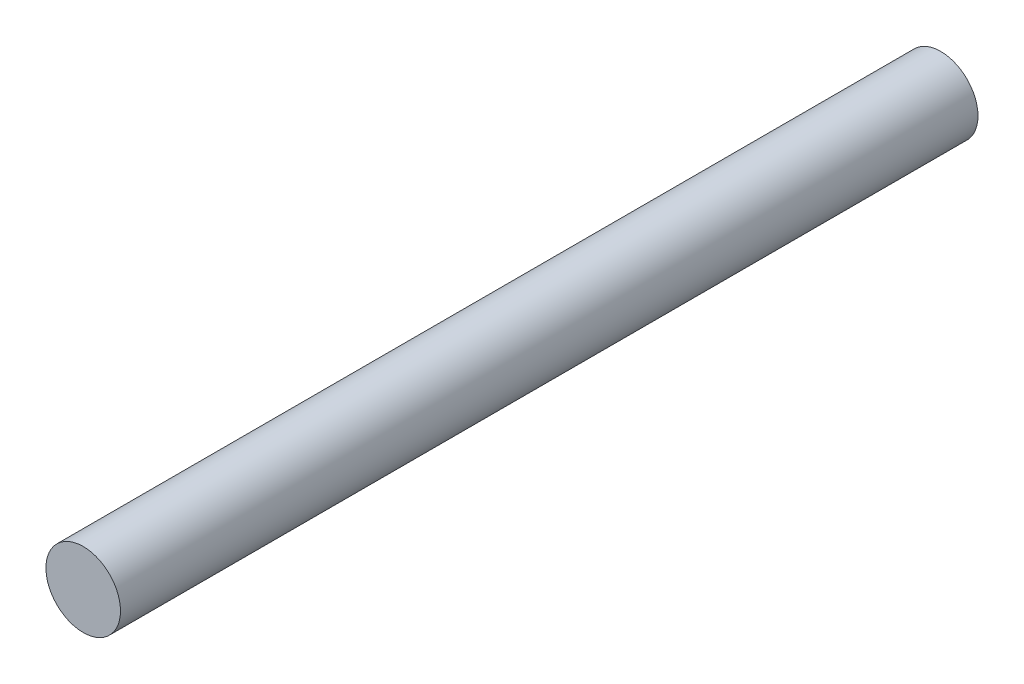
ISO-10303-21;
HEADER;
FILE_DESCRIPTION(('STEP AP214'),'2;1');
FILE_NAME('part.step','',(''),(''),'','','');
FILE_SCHEMA(('AUTOMOTIVE_DESIGN { 1 0 10303 214 1 1 1 1 }'));
ENDSEC;
DATA;
#1=APPLICATION_CONTEXT('core data for automotive mechanical design processes');
#2=APPLICATION_PROTOCOL_DEFINITION('international standard','automotive_design',2000,#1);
#3=PRODUCT_CONTEXT('',#1,'mechanical');
#4=PRODUCT('Part','Part','',(#3));
#5=PRODUCT_RELATED_PRODUCT_CATEGORY('part','',(#4));
#6=PRODUCT_DEFINITION_FORMATION('','',#4);
#7=PRODUCT_DEFINITION_CONTEXT('part definition',#1,'design');
#8=PRODUCT_DEFINITION('design','',#6,#7);
#9=PRODUCT_DEFINITION_SHAPE('','',#8);
#10=(LENGTH_UNIT() NAMED_UNIT(*) SI_UNIT(.MILLI.,.METRE.));
#11=(NAMED_UNIT(*) PLANE_ANGLE_UNIT() SI_UNIT($,.RADIAN.));
#12=(NAMED_UNIT(*) SI_UNIT($,.STERADIAN.) SOLID_ANGLE_UNIT());
#13=UNCERTAINTY_MEASURE_WITH_UNIT(LENGTH_MEASURE(1.E-05),#10,'distance_accuracy_value','');
#14=(GEOMETRIC_REPRESENTATION_CONTEXT(3) GLOBAL_UNCERTAINTY_ASSIGNED_CONTEXT((#13)) GLOBAL_UNIT_ASSIGNED_CONTEXT((#10,
#11,#12)) REPRESENTATION_CONTEXT('',''));
#15=CARTESIAN_POINT('',(0.,0.,0.));
#16=DIRECTION('',(0.,0.,1.));
#17=DIRECTION('',(1.,0.,0.));
#18=AXIS2_PLACEMENT_3D('',#15,#16,#17);
#19=CARTESIAN_POINT('',(0.,0.,92.));
#20=DIRECTION('',(0.,0.,-1.));
#21=DIRECTION('',(-1.,0.,0.));
#22=AXIS2_PLACEMENT_3D('',#19,#20,#21);
#23=CYLINDRICAL_SURFACE('',#22,4.);
#24=CARTESIAN_POINT('',(0.,0.,92.));
#25=DIRECTION('',(0.,0.,1.));
#26=DIRECTION('',(1.,0.,0.));
#27=AXIS2_PLACEMENT_3D('',#24,#25,#26);
#28=CIRCLE('',#27,4.);
#29=CARTESIAN_POINT('',(4.,0.,92.));
#30=VERTEX_POINT('',#29);
#31=EDGE_CURVE('E10',#30,#30,#28,.T.);
#32=ORIENTED_EDGE('',*,*,#31,.F.);
#33=EDGE_LOOP('',(#32));
#34=FACE_BOUND('',#33,.T.);
#35=CARTESIAN_POINT('',(0.,0.,0.));
#36=DIRECTION('',(0.,0.,1.));
#37=DIRECTION('',(1.,0.,0.));
#38=AXIS2_PLACEMENT_3D('',#35,#36,#37);
#39=CIRCLE('',#38,4.);
#40=CARTESIAN_POINT('',(4.,0.,0.));
#41=VERTEX_POINT('',#40);
#42=EDGE_CURVE('E33',#41,#41,#39,.T.);
#43=ORIENTED_EDGE('',*,*,#42,.T.);
#44=EDGE_LOOP('',(#43));
#45=FACE_BOUND('',#44,.T.);
#46=ADVANCED_FACE('F30',(#34,#45),#23,.T.);
#47=CARTESIAN_POINT('',(0.,0.,92.));
#48=DIRECTION('',(0.,0.,1.));
#49=DIRECTION('',(1.,0.,0.));
#50=AXIS2_PLACEMENT_3D('',#47,#48,#49);
#51=PLANE('',#50);
#52=ORIENTED_EDGE('',*,*,#31,.T.);
#53=EDGE_LOOP('',(#52));
#54=FACE_BOUND('',#53,.T.);
#55=ADVANCED_FACE('F45',(#54),#51,.T.);
#56=CARTESIAN_POINT('',(0.,0.,0.));
#57=DIRECTION('',(0.,0.,1.));
#58=DIRECTION('',(1.,0.,0.));
#59=AXIS2_PLACEMENT_3D('',#56,#57,#58);
#60=PLANE('',#59);
#61=ORIENTED_EDGE('',*,*,#42,.F.);
#62=EDGE_LOOP('',(#61));
#63=FACE_BOUND('',#62,.T.);
#64=ADVANCED_FACE('F43',(#63),#60,.F.);
#65=CLOSED_SHELL('',(#46,#55,#64));
#66=MANIFOLD_SOLID_BREP('B2',#65);
#67=ADVANCED_BREP_SHAPE_REPRESENTATION('',(#18,#66),#14);
#68=SHAPE_DEFINITION_REPRESENTATION(#9,#67);
ENDSEC;
END-ISO-10303-21;
